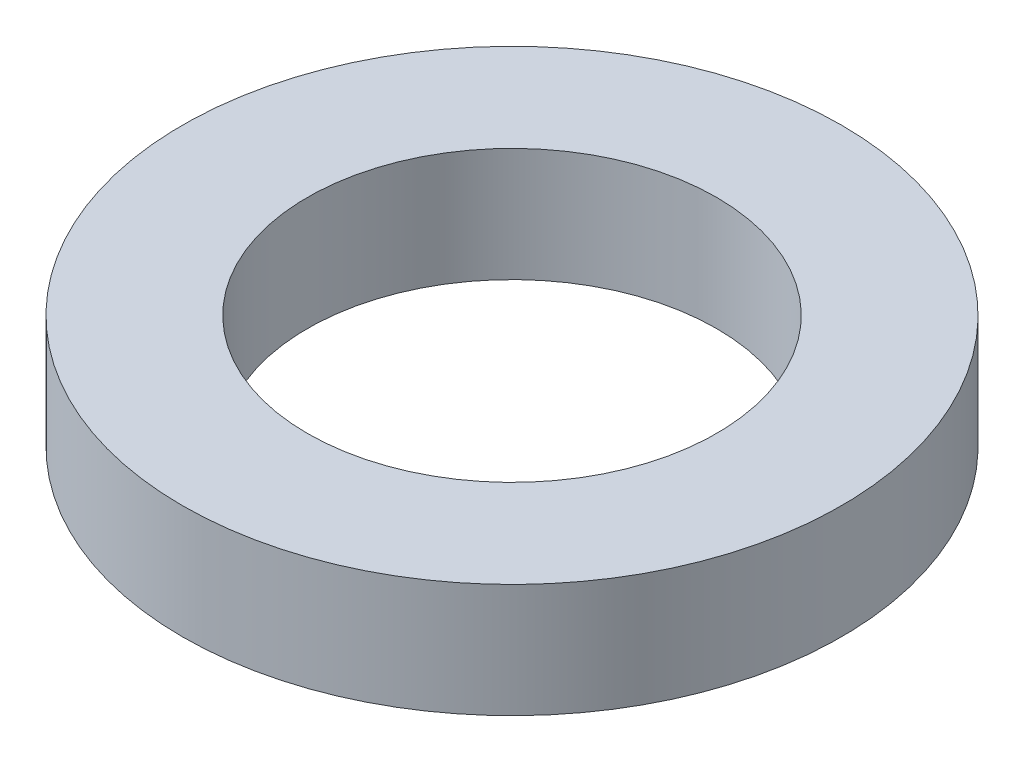
ISO-10303-21;
HEADER;
FILE_DESCRIPTION(('STEP AP214'),'2;1');
FILE_NAME('part.step','',(''),(''),'','','');
FILE_SCHEMA(('AUTOMOTIVE_DESIGN { 1 0 10303 214 1 1 1 1 }'));
ENDSEC;
DATA;
#1=APPLICATION_CONTEXT('core data for automotive mechanical design processes');
#2=APPLICATION_PROTOCOL_DEFINITION('international standard','automotive_design',2000,#1);
#3=PRODUCT_CONTEXT('',#1,'mechanical');
#4=PRODUCT('Part','Part','',(#3));
#5=PRODUCT_RELATED_PRODUCT_CATEGORY('part','',(#4));
#6=PRODUCT_DEFINITION_FORMATION('','',#4);
#7=PRODUCT_DEFINITION_CONTEXT('part definition',#1,'design');
#8=PRODUCT_DEFINITION('design','',#6,#7);
#9=PRODUCT_DEFINITION_SHAPE('','',#8);
#10=(LENGTH_UNIT() NAMED_UNIT(*) SI_UNIT(.MILLI.,.METRE.));
#11=(NAMED_UNIT(*) PLANE_ANGLE_UNIT() SI_UNIT($,.RADIAN.));
#12=(NAMED_UNIT(*) SI_UNIT($,.STERADIAN.) SOLID_ANGLE_UNIT());
#13=UNCERTAINTY_MEASURE_WITH_UNIT(LENGTH_MEASURE(1.E-05),#10,'distance_accuracy_value','');
#14=(GEOMETRIC_REPRESENTATION_CONTEXT(3) GLOBAL_UNCERTAINTY_ASSIGNED_CONTEXT((#13)) GLOBAL_UNIT_ASSIGNED_CONTEXT((#10,
#11,#12)) REPRESENTATION_CONTEXT('',''));
#15=CARTESIAN_POINT('',(0.,0.,0.));
#16=DIRECTION('',(0.,0.,1.));
#17=DIRECTION('',(1.,0.,0.));
#18=AXIS2_PLACEMENT_3D('',#15,#16,#17);
#19=CARTESIAN_POINT('',(0.,25.,0.));
#20=DIRECTION('',(0.,-1.,0.));
#21=DIRECTION('',(0.,0.,-1.));
#22=AXIS2_PLACEMENT_3D('',#19,#20,#21);
#23=CYLINDRICAL_SURFACE('',#22,72.5);
#24=CARTESIAN_POINT('',(0.,25.,0.));
#25=DIRECTION('',(0.,1.,0.));
#26=DIRECTION('',(0.,0.,1.));
#27=AXIS2_PLACEMENT_3D('',#24,#25,#26);
#28=CIRCLE('',#27,72.5);
#29=CARTESIAN_POINT('',(0.,25.,72.5));
#30=VERTEX_POINT('',#29);
#31=EDGE_CURVE('E10',#30,#30,#28,.T.);
#32=ORIENTED_EDGE('',*,*,#31,.F.);
#33=EDGE_LOOP('',(#32));
#34=FACE_BOUND('',#33,.T.);
#35=CARTESIAN_POINT('',(0.,0.,0.));
#36=DIRECTION('',(0.,1.,0.));
#37=DIRECTION('',(0.,0.,1.));
#38=AXIS2_PLACEMENT_3D('',#35,#36,#37);
#39=CIRCLE('',#38,72.5);
#40=CARTESIAN_POINT('',(0.,0.,72.5));
#41=VERTEX_POINT('',#40);
#42=EDGE_CURVE('E37',#41,#41,#39,.T.);
#43=ORIENTED_EDGE('',*,*,#42,.T.);
#44=EDGE_LOOP('',(#43));
#45=FACE_BOUND('',#44,.T.);
#46=ADVANCED_FACE('F40',(#34,#45),#23,.T.);
#47=CARTESIAN_POINT('',(0.,25.,0.));
#48=DIRECTION('',(0.,1.,0.));
#49=DIRECTION('',(0.,0.,1.));
#50=AXIS2_PLACEMENT_3D('',#47,#48,#49);
#51=PLANE('',#50);
#52=CARTESIAN_POINT('',(0.,25.,0.));
#53=DIRECTION('',(0.,1.,0.));
#54=DIRECTION('',(0.,0.,1.));
#55=AXIS2_PLACEMENT_3D('',#52,#53,#54);
#56=CIRCLE('',#55,45.);
#57=CARTESIAN_POINT('',(0.,25.,45.));
#58=VERTEX_POINT('',#57);
#59=EDGE_CURVE('E50',#58,#58,#56,.T.);
#60=ORIENTED_EDGE('',*,*,#59,.F.);
#61=EDGE_LOOP('',(#60));
#62=FACE_BOUND('',#61,.T.);
#63=ORIENTED_EDGE('',*,*,#31,.T.);
#64=EDGE_LOOP('',(#63));
#65=FACE_BOUND('',#64,.T.);
#66=ADVANCED_FACE('F59',(#62,#65),#51,.T.);
#67=CARTESIAN_POINT('',(0.,0.,0.));
#68=DIRECTION('',(0.,1.,0.));
#69=DIRECTION('',(0.,0.,1.));
#70=AXIS2_PLACEMENT_3D('',#67,#68,#69);
#71=PLANE('',#70);
#72=CARTESIAN_POINT('',(0.,0.,0.));
#73=DIRECTION('',(0.,1.,0.));
#74=DIRECTION('',(0.,0.,1.));
#75=AXIS2_PLACEMENT_3D('',#72,#73,#74);
#76=CIRCLE('',#75,45.);
#77=CARTESIAN_POINT('',(0.,0.,45.));
#78=VERTEX_POINT('',#77);
#79=EDGE_CURVE('E47',#78,#78,#76,.T.);
#80=ORIENTED_EDGE('',*,*,#79,.T.);
#81=EDGE_LOOP('',(#80));
#82=FACE_BOUND('',#81,.T.);
#83=ORIENTED_EDGE('',*,*,#42,.F.);
#84=EDGE_LOOP('',(#83));
#85=FACE_BOUND('',#84,.T.);
#86=ADVANCED_FACE('F58',(#82,#85),#71,.F.);
#87=CARTESIAN_POINT('',(0.,25.,0.));
#88=DIRECTION('',(0.,-1.,0.));
#89=DIRECTION('',(0.,0.,-1.));
#90=AXIS2_PLACEMENT_3D('',#87,#88,#89);
#91=CYLINDRICAL_SURFACE('',#90,45.);
#92=ORIENTED_EDGE('',*,*,#59,.T.);
#93=EDGE_LOOP('',(#92));
#94=FACE_BOUND('',#93,.T.);
#95=ORIENTED_EDGE('',*,*,#79,.F.);
#96=EDGE_LOOP('',(#95));
#97=FACE_BOUND('',#96,.T.);
#98=ADVANCED_FACE('F54',(#94,#97),#91,.F.);
#99=CLOSED_SHELL('',(#46,#66,#86,#98));
#100=MANIFOLD_SOLID_BREP('B2',#99);
#101=ADVANCED_BREP_SHAPE_REPRESENTATION('',(#18,#100),#14);
#102=SHAPE_DEFINITION_REPRESENTATION(#9,#101);
ENDSEC;
END-ISO-10303-21;
